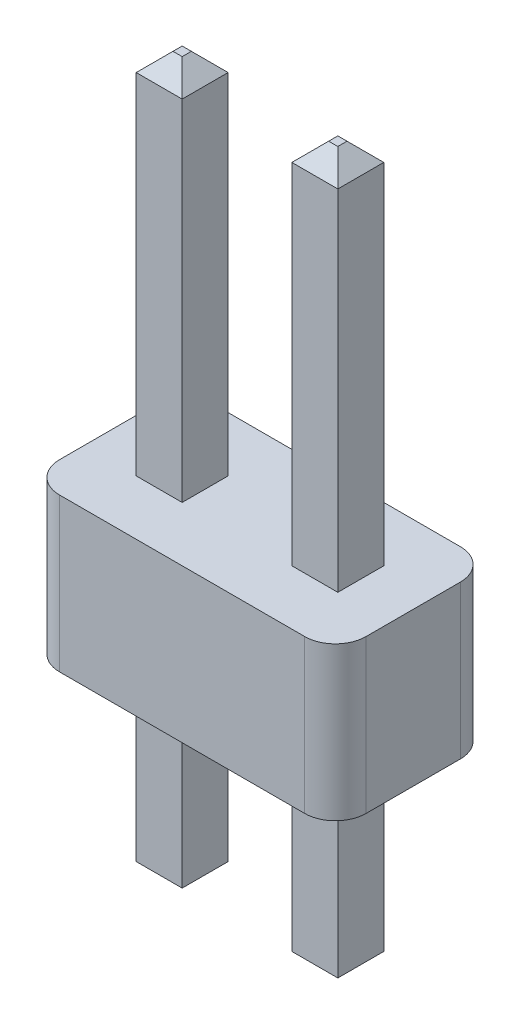
ISO-10303-21;
HEADER;
FILE_DESCRIPTION(('STEP AP214'),'2;1');
FILE_NAME('part.step','',(''),(''),'','','');
FILE_SCHEMA(('AUTOMOTIVE_DESIGN { 1 0 10303 214 1 1 1 1 }'));
ENDSEC;
DATA;
#1=APPLICATION_CONTEXT('core data for automotive mechanical design processes');
#2=APPLICATION_PROTOCOL_DEFINITION('international standard','automotive_design',2000,#1);
#3=PRODUCT_CONTEXT('',#1,'mechanical');
#4=PRODUCT('Part','Part','',(#3));
#5=PRODUCT_RELATED_PRODUCT_CATEGORY('part','',(#4));
#6=PRODUCT_DEFINITION_FORMATION('','',#4);
#7=PRODUCT_DEFINITION_CONTEXT('part definition',#1,'design');
#8=PRODUCT_DEFINITION('design','',#6,#7);
#9=PRODUCT_DEFINITION_SHAPE('','',#8);
#10=(LENGTH_UNIT() NAMED_UNIT(*) SI_UNIT(.MILLI.,.METRE.));
#11=(NAMED_UNIT(*) PLANE_ANGLE_UNIT() SI_UNIT($,.RADIAN.));
#12=(NAMED_UNIT(*) SI_UNIT($,.STERADIAN.) SOLID_ANGLE_UNIT());
#13=UNCERTAINTY_MEASURE_WITH_UNIT(LENGTH_MEASURE(1.E-05),#10,'distance_accuracy_value','');
#14=(GEOMETRIC_REPRESENTATION_CONTEXT(3) GLOBAL_UNCERTAINTY_ASSIGNED_CONTEXT((#13)) GLOBAL_UNIT_ASSIGNED_CONTEXT((#10,
#11,#12)) REPRESENTATION_CONTEXT('',''));
#15=CARTESIAN_POINT('',(0.,0.,0.));
#16=DIRECTION('',(0.,0.,1.));
#17=DIRECTION('',(1.,0.,0.));
#18=AXIS2_PLACEMENT_3D('',#15,#16,#17);
#19=CARTESIAN_POINT('',(2.,2.5,0.77));
#20=DIRECTION('',(0.,-1.,0.));
#21=DIRECTION('',(0.,0.,-1.));
#22=AXIS2_PLACEMENT_3D('',#19,#20,#21);
#23=CYLINDRICAL_SURFACE('',#22,0.5);
#24=CARTESIAN_POINT('',(2.,0.,0.77));
#25=DIRECTION('',(0.,1.,0.));
#26=DIRECTION('',(0.,0.,1.));
#27=AXIS2_PLACEMENT_3D('',#24,#25,#26);
#28=CIRCLE('',#27,0.5);
#29=CARTESIAN_POINT('',(2.,0.,1.27));
#30=VERTEX_POINT('',#29);
#31=CARTESIAN_POINT('',(2.5,0.,0.77));
#32=VERTEX_POINT('',#31);
#33=EDGE_CURVE('E302',#30,#32,#28,.T.);
#34=ORIENTED_EDGE('',*,*,#33,.T.);
#35=DIRECTION('',(0.,-1.,0.));
#36=VECTOR('',#35,1.);
#37=CARTESIAN_POINT('',(2.5,2.5,0.77));
#38=LINE('',#37,#36);
#39=CARTESIAN_POINT('',(2.5,2.5,0.77));
#40=VERTEX_POINT('',#39);
#41=EDGE_CURVE('E361',#40,#32,#38,.T.);
#42=ORIENTED_EDGE('',*,*,#41,.F.);
#43=CARTESIAN_POINT('',(2.,2.5,0.77));
#44=DIRECTION('',(0.,1.,0.));
#45=DIRECTION('',(0.,0.,1.));
#46=AXIS2_PLACEMENT_3D('',#43,#44,#45);
#47=CIRCLE('',#46,0.5);
#48=CARTESIAN_POINT('',(2.,2.5,1.27));
#49=VERTEX_POINT('',#48);
#50=EDGE_CURVE('E303',#49,#40,#47,.T.);
#51=ORIENTED_EDGE('',*,*,#50,.F.);
#52=DIRECTION('',(0.,-1.,0.));
#53=VECTOR('',#52,1.);
#54=CARTESIAN_POINT('',(2.,2.5,1.27));
#55=LINE('',#54,#53);
#56=EDGE_CURVE('E323',#49,#30,#55,.T.);
#57=ORIENTED_EDGE('',*,*,#56,.T.);
#58=EDGE_LOOP('',(#34,#42,#51,#57));
#59=FACE_BOUND('',#58,.T.);
#60=ADVANCED_FACE('F36',(#59),#23,.T.);
#61=CARTESIAN_POINT('',(2.5,2.5,-0.77));
#62=DIRECTION('',(-1.,0.,0.));
#63=DIRECTION('',(0.,0.,1.));
#64=AXIS2_PLACEMENT_3D('',#61,#62,#63);
#65=PLANE('',#64);
#66=DIRECTION('',(0.,0.,-1.));
#67=VECTOR('',#66,1.);
#68=CARTESIAN_POINT('',(2.5,0.,-0.77));
#69=LINE('',#68,#67);
#70=CARTESIAN_POINT('',(2.5,0.,-0.77));
#71=VERTEX_POINT('',#70);
#72=EDGE_CURVE('E326',#32,#71,#69,.T.);
#73=ORIENTED_EDGE('',*,*,#72,.T.);
#74=DIRECTION('',(0.,-1.,0.));
#75=VECTOR('',#74,1.);
#76=CARTESIAN_POINT('',(2.5,2.5,-0.77));
#77=LINE('',#76,#75);
#78=CARTESIAN_POINT('',(2.5,2.5,-0.77));
#79=VERTEX_POINT('',#78);
#80=EDGE_CURVE('E358',#79,#71,#77,.T.);
#81=ORIENTED_EDGE('',*,*,#80,.F.);
#82=DIRECTION('',(0.,0.,-1.));
#83=VECTOR('',#82,1.);
#84=CARTESIAN_POINT('',(2.5,2.5,-0.77));
#85=LINE('',#84,#83);
#86=EDGE_CURVE('E306',#40,#79,#85,.T.);
#87=ORIENTED_EDGE('',*,*,#86,.F.);
#88=ORIENTED_EDGE('',*,*,#41,.T.);
#89=EDGE_LOOP('',(#73,#81,#87,#88));
#90=FACE_BOUND('',#89,.T.);
#91=ADVANCED_FACE('F527',(#90),#65,.F.);
#92=CARTESIAN_POINT('',(2.,2.5,-0.77));
#93=DIRECTION('',(0.,-1.,0.));
#94=DIRECTION('',(0.,0.,-1.));
#95=AXIS2_PLACEMENT_3D('',#92,#93,#94);
#96=CYLINDRICAL_SURFACE('',#95,0.5);
#97=CARTESIAN_POINT('',(2.,0.,-0.77));
#98=DIRECTION('',(0.,1.,0.));
#99=DIRECTION('',(0.,0.,1.));
#100=AXIS2_PLACEMENT_3D('',#97,#98,#99);
#101=CIRCLE('',#100,0.5);
#102=CARTESIAN_POINT('',(2.,0.,-1.27));
#103=VERTEX_POINT('',#102);
#104=EDGE_CURVE('E328',#71,#103,#101,.T.);
#105=ORIENTED_EDGE('',*,*,#104,.T.);
#106=DIRECTION('',(0.,-1.,0.));
#107=VECTOR('',#106,1.);
#108=CARTESIAN_POINT('',(2.,2.5,-1.27));
#109=LINE('',#108,#107);
#110=CARTESIAN_POINT('',(2.,2.5,-1.27));
#111=VERTEX_POINT('',#110);
#112=EDGE_CURVE('E355',#111,#103,#109,.T.);
#113=ORIENTED_EDGE('',*,*,#112,.F.);
#114=CARTESIAN_POINT('',(2.,2.5,-0.77));
#115=DIRECTION('',(0.,1.,0.));
#116=DIRECTION('',(0.,0.,1.));
#117=AXIS2_PLACEMENT_3D('',#114,#115,#116);
#118=CIRCLE('',#117,0.5);
#119=EDGE_CURVE('E309',#79,#111,#118,.T.);
#120=ORIENTED_EDGE('',*,*,#119,.F.);
#121=ORIENTED_EDGE('',*,*,#80,.T.);
#122=EDGE_LOOP('',(#105,#113,#120,#121));
#123=FACE_BOUND('',#122,.T.);
#124=ADVANCED_FACE('F533',(#123),#96,.T.);
#125=CARTESIAN_POINT('',(-2.,2.5,-1.27));
#126=DIRECTION('',(0.,0.,1.));
#127=DIRECTION('',(1.,0.,0.));
#128=AXIS2_PLACEMENT_3D('',#125,#126,#127);
#129=PLANE('',#128);
#130=DIRECTION('',(-1.,0.,0.));
#131=VECTOR('',#130,1.);
#132=CARTESIAN_POINT('',(-2.,0.,-1.27));
#133=LINE('',#132,#131);
#134=CARTESIAN_POINT('',(-2.,0.,-1.27));
#135=VERTEX_POINT('',#134);
#136=EDGE_CURVE('E330',#103,#135,#133,.T.);
#137=ORIENTED_EDGE('',*,*,#136,.T.);
#138=DIRECTION('',(0.,-1.,0.));
#139=VECTOR('',#138,1.);
#140=CARTESIAN_POINT('',(-2.,2.5,-1.27));
#141=LINE('',#140,#139);
#142=CARTESIAN_POINT('',(-2.,2.5,-1.27));
#143=VERTEX_POINT('',#142);
#144=EDGE_CURVE('E352',#143,#135,#141,.T.);
#145=ORIENTED_EDGE('',*,*,#144,.F.);
#146=DIRECTION('',(-1.,0.,0.));
#147=VECTOR('',#146,1.);
#148=CARTESIAN_POINT('',(-2.,2.5,-1.27));
#149=LINE('',#148,#147);
#150=EDGE_CURVE('E311',#111,#143,#149,.T.);
#151=ORIENTED_EDGE('',*,*,#150,.F.);
#152=ORIENTED_EDGE('',*,*,#112,.T.);
#153=EDGE_LOOP('',(#137,#145,#151,#152));
#154=FACE_BOUND('',#153,.T.);
#155=ADVANCED_FACE('F877',(#154),#129,.F.);
#156=CARTESIAN_POINT('',(-2.,2.5,-0.77));
#157=DIRECTION('',(0.,-1.,0.));
#158=DIRECTION('',(0.,0.,-1.));
#159=AXIS2_PLACEMENT_3D('',#156,#157,#158);
#160=CYLINDRICAL_SURFACE('',#159,0.5);
#161=CARTESIAN_POINT('',(-2.,0.,-0.77));
#162=DIRECTION('',(0.,1.,0.));
#163=DIRECTION('',(0.,0.,1.));
#164=AXIS2_PLACEMENT_3D('',#161,#162,#163);
#165=CIRCLE('',#164,0.5);
#166=CARTESIAN_POINT('',(-2.5,0.,-0.77));
#167=VERTEX_POINT('',#166);
#168=EDGE_CURVE('E333',#135,#167,#165,.T.);
#169=ORIENTED_EDGE('',*,*,#168,.T.);
#170=DIRECTION('',(0.,-1.,0.));
#171=VECTOR('',#170,1.);
#172=CARTESIAN_POINT('',(-2.5,2.5,-0.77));
#173=LINE('',#172,#171);
#174=CARTESIAN_POINT('',(-2.5,2.5,-0.77));
#175=VERTEX_POINT('',#174);
#176=EDGE_CURVE('E349',#175,#167,#173,.T.);
#177=ORIENTED_EDGE('',*,*,#176,.F.);
#178=CARTESIAN_POINT('',(-2.,2.5,-0.77));
#179=DIRECTION('',(0.,1.,0.));
#180=DIRECTION('',(0.,0.,1.));
#181=AXIS2_PLACEMENT_3D('',#178,#179,#180);
#182=CIRCLE('',#181,0.5);
#183=EDGE_CURVE('E314',#143,#175,#182,.T.);
#184=ORIENTED_EDGE('',*,*,#183,.F.);
#185=ORIENTED_EDGE('',*,*,#144,.T.);
#186=EDGE_LOOP('',(#169,#177,#184,#185));
#187=FACE_BOUND('',#186,.T.);
#188=ADVANCED_FACE('F866',(#187),#160,.T.);
#189=CARTESIAN_POINT('',(-2.5,2.5,0.77));
#190=DIRECTION('',(1.,0.,0.));
#191=DIRECTION('',(0.,0.,-1.));
#192=AXIS2_PLACEMENT_3D('',#189,#190,#191);
#193=PLANE('',#192);
#194=DIRECTION('',(0.,0.,1.));
#195=VECTOR('',#194,1.);
#196=CARTESIAN_POINT('',(-2.5,0.,0.77));
#197=LINE('',#196,#195);
#198=CARTESIAN_POINT('',(-2.5,0.,0.77));
#199=VERTEX_POINT('',#198);
#200=EDGE_CURVE('E335',#167,#199,#197,.T.);
#201=ORIENTED_EDGE('',*,*,#200,.T.);
#202=DIRECTION('',(0.,-1.,0.));
#203=VECTOR('',#202,1.);
#204=CARTESIAN_POINT('',(-2.5,2.5,0.77));
#205=LINE('',#204,#203);
#206=CARTESIAN_POINT('',(-2.5,2.5,0.77));
#207=VERTEX_POINT('',#206);
#208=EDGE_CURVE('E346',#207,#199,#205,.T.);
#209=ORIENTED_EDGE('',*,*,#208,.F.);
#210=DIRECTION('',(0.,0.,1.));
#211=VECTOR('',#210,1.);
#212=CARTESIAN_POINT('',(-2.5,2.5,0.77));
#213=LINE('',#212,#211);
#214=EDGE_CURVE('E316',#175,#207,#213,.T.);
#215=ORIENTED_EDGE('',*,*,#214,.F.);
#216=ORIENTED_EDGE('',*,*,#176,.T.);
#217=EDGE_LOOP('',(#201,#209,#215,#216));
#218=FACE_BOUND('',#217,.T.);
#219=ADVANCED_FACE('F855',(#218),#193,.F.);
#220=CARTESIAN_POINT('',(-2.,2.5,0.77));
#221=DIRECTION('',(0.,-1.,0.));
#222=DIRECTION('',(0.,0.,-1.));
#223=AXIS2_PLACEMENT_3D('',#220,#221,#222);
#224=CYLINDRICAL_SURFACE('',#223,0.5);
#225=CARTESIAN_POINT('',(-2.,0.,0.77));
#226=DIRECTION('',(0.,1.,0.));
#227=DIRECTION('',(0.,0.,1.));
#228=AXIS2_PLACEMENT_3D('',#225,#226,#227);
#229=CIRCLE('',#228,0.5);
#230=CARTESIAN_POINT('',(-2.,0.,1.27));
#231=VERTEX_POINT('',#230);
#232=EDGE_CURVE('E337',#199,#231,#229,.T.);
#233=ORIENTED_EDGE('',*,*,#232,.T.);
#234=DIRECTION('',(0.,-1.,0.));
#235=VECTOR('',#234,1.);
#236=CARTESIAN_POINT('',(-2.,2.5,1.27));
#237=LINE('',#236,#235);
#238=CARTESIAN_POINT('',(-2.,2.5,1.27));
#239=VERTEX_POINT('',#238);
#240=EDGE_CURVE('E343',#239,#231,#237,.T.);
#241=ORIENTED_EDGE('',*,*,#240,.F.);
#242=CARTESIAN_POINT('',(-2.,2.5,0.77));
#243=DIRECTION('',(0.,1.,0.));
#244=DIRECTION('',(0.,0.,1.));
#245=AXIS2_PLACEMENT_3D('',#242,#243,#244);
#246=CIRCLE('',#245,0.5);
#247=EDGE_CURVE('E318',#207,#239,#246,.T.);
#248=ORIENTED_EDGE('',*,*,#247,.F.);
#249=ORIENTED_EDGE('',*,*,#208,.T.);
#250=EDGE_LOOP('',(#233,#241,#248,#249));
#251=FACE_BOUND('',#250,.T.);
#252=ADVANCED_FACE('F844',(#251),#224,.T.);
#253=CARTESIAN_POINT('',(2.,2.5,1.27));
#254=DIRECTION('',(0.,0.,-1.));
#255=DIRECTION('',(-1.,0.,0.));
#256=AXIS2_PLACEMENT_3D('',#253,#254,#255);
#257=PLANE('',#256);
#258=DIRECTION('',(1.,0.,0.));
#259=VECTOR('',#258,1.);
#260=CARTESIAN_POINT('',(2.,0.,1.27));
#261=LINE('',#260,#259);
#262=EDGE_CURVE('E307',#231,#30,#261,.T.);
#263=ORIENTED_EDGE('',*,*,#262,.T.);
#264=ORIENTED_EDGE('',*,*,#56,.F.);
#265=DIRECTION('',(1.,0.,0.));
#266=VECTOR('',#265,1.);
#267=CARTESIAN_POINT('',(2.,2.5,1.27));
#268=LINE('',#267,#266);
#269=EDGE_CURVE('E320',#239,#49,#268,.T.);
#270=ORIENTED_EDGE('',*,*,#269,.F.);
#271=ORIENTED_EDGE('',*,*,#240,.T.);
#272=EDGE_LOOP('',(#263,#264,#270,#271));
#273=FACE_BOUND('',#272,.T.);
#274=ADVANCED_FACE('F834',(#273),#257,.F.);
#275=CARTESIAN_POINT('',(2.,2.5,0.77));
#276=DIRECTION('',(0.,1.,0.));
#277=DIRECTION('',(0.,0.,1.));
#278=AXIS2_PLACEMENT_3D('',#275,#276,#277);
#279=PLANE('',#278);
#280=DIRECTION('',(0.,0.,1.));
#281=VECTOR('',#280,1.);
#282=CARTESIAN_POINT('',(0.895,2.5,0.77));
#283=LINE('',#282,#281);
#284=CARTESIAN_POINT('',(0.895,2.5,-0.375));
#285=VERTEX_POINT('',#284);
#286=CARTESIAN_POINT('',(0.895,2.5,0.375));
#287=VERTEX_POINT('',#286);
#288=EDGE_CURVE('E276',#285,#287,#283,.T.);
#289=ORIENTED_EDGE('',*,*,#288,.F.);
#290=DIRECTION('',(-1.,0.,0.));
#291=VECTOR('',#290,1.);
#292=CARTESIAN_POINT('',(2.,2.5,-0.375));
#293=LINE('',#292,#291);
#294=CARTESIAN_POINT('',(1.645,2.5,-0.375));
#295=VERTEX_POINT('',#294);
#296=EDGE_CURVE('E254',#295,#285,#293,.T.);
#297=ORIENTED_EDGE('',*,*,#296,.F.);
#298=DIRECTION('',(0.,0.,-1.));
#299=VECTOR('',#298,1.);
#300=CARTESIAN_POINT('',(1.645,2.5,0.77));
#301=LINE('',#300,#299);
#302=CARTESIAN_POINT('',(1.645,2.5,0.375));
#303=VERTEX_POINT('',#302);
#304=EDGE_CURVE('E247',#303,#295,#301,.T.);
#305=ORIENTED_EDGE('',*,*,#304,.F.);
#306=DIRECTION('',(1.,0.,0.));
#307=VECTOR('',#306,1.);
#308=CARTESIAN_POINT('',(2.,2.5,0.375));
#309=LINE('',#308,#307);
#310=EDGE_CURVE('E251',#287,#303,#309,.T.);
#311=ORIENTED_EDGE('',*,*,#310,.F.);
#312=EDGE_LOOP('',(#289,#297,#305,#311));
#313=FACE_BOUND('',#312,.T.);
#314=DIRECTION('',(0.,0.,-1.));
#315=VECTOR('',#314,1.);
#316=CARTESIAN_POINT('',(-0.895,2.5,0.77));
#317=LINE('',#316,#315);
#318=CARTESIAN_POINT('',(-0.895,2.5,0.375));
#319=VERTEX_POINT('',#318);
#320=CARTESIAN_POINT('',(-0.895,2.5,-0.375));
#321=VERTEX_POINT('',#320);
#322=EDGE_CURVE('E299',#319,#321,#317,.T.);
#323=ORIENTED_EDGE('',*,*,#322,.F.);
#324=DIRECTION('',(1.,0.,0.));
#325=VECTOR('',#324,1.);
#326=CARTESIAN_POINT('',(2.,2.5,0.375));
#327=LINE('',#326,#325);
#328=CARTESIAN_POINT('',(-1.645,2.5,0.375));
#329=VERTEX_POINT('',#328);
#330=EDGE_CURVE('E296',#329,#319,#327,.T.);
#331=ORIENTED_EDGE('',*,*,#330,.F.);
#332=DIRECTION('',(0.,0.,1.));
#333=VECTOR('',#332,1.);
#334=CARTESIAN_POINT('',(-1.645,2.5,0.77));
#335=LINE('',#334,#333);
#336=CARTESIAN_POINT('',(-1.645,2.5,-0.375));
#337=VERTEX_POINT('',#336);
#338=EDGE_CURVE('E293',#337,#329,#335,.T.);
#339=ORIENTED_EDGE('',*,*,#338,.F.);
#340=DIRECTION('',(-1.,0.,0.));
#341=VECTOR('',#340,1.);
#342=CARTESIAN_POINT('',(2.,2.5,-0.375));
#343=LINE('',#342,#341);
#344=EDGE_CURVE('E281',#321,#337,#343,.T.);
#345=ORIENTED_EDGE('',*,*,#344,.F.);
#346=EDGE_LOOP('',(#323,#331,#339,#345));
#347=FACE_BOUND('',#346,.T.);
#348=ORIENTED_EDGE('',*,*,#50,.T.);
#349=ORIENTED_EDGE('',*,*,#86,.T.);
#350=ORIENTED_EDGE('',*,*,#119,.T.);
#351=ORIENTED_EDGE('',*,*,#150,.T.);
#352=ORIENTED_EDGE('',*,*,#183,.T.);
#353=ORIENTED_EDGE('',*,*,#214,.T.);
#354=ORIENTED_EDGE('',*,*,#247,.T.);
#355=ORIENTED_EDGE('',*,*,#269,.T.);
#356=EDGE_LOOP('',(#348,#349,#350,#351,#352,#353,#354,#355));
#357=FACE_BOUND('',#356,.T.);
#358=ADVANCED_FACE('F249',(#313,#347,#357),#279,.T.);
#359=CARTESIAN_POINT('',(2.,0.,0.77));
#360=DIRECTION('',(0.,1.,0.));
#361=DIRECTION('',(0.,0.,1.));
#362=AXIS2_PLACEMENT_3D('',#359,#360,#361);
#363=PLANE('',#362);
#364=DIRECTION('',(-1.,0.,0.));
#365=VECTOR('',#364,1.);
#366=CARTESIAN_POINT('',(2.,0.,-0.375));
#367=LINE('',#366,#365);
#368=CARTESIAN_POINT('',(1.645,0.,-0.375));
#369=VERTEX_POINT('',#368);
#370=CARTESIAN_POINT('',(0.895,0.,-0.375));
#371=VERTEX_POINT('',#370);
#372=EDGE_CURVE('E382',#369,#371,#367,.T.);
#373=ORIENTED_EDGE('',*,*,#372,.T.);
#374=DIRECTION('',(0.,0.,1.));
#375=VECTOR('',#374,1.);
#376=CARTESIAN_POINT('',(0.895,0.,0.77));
#377=LINE('',#376,#375);
#378=CARTESIAN_POINT('',(0.895,0.,0.375));
#379=VERTEX_POINT('',#378);
#380=EDGE_CURVE('E385',#371,#379,#377,.T.);
#381=ORIENTED_EDGE('',*,*,#380,.T.);
#382=DIRECTION('',(1.,0.,0.));
#383=VECTOR('',#382,1.);
#384=CARTESIAN_POINT('',(2.,0.,0.375));
#385=LINE('',#384,#383);
#386=CARTESIAN_POINT('',(1.645,0.,0.375));
#387=VERTEX_POINT('',#386);
#388=EDGE_CURVE('E376',#379,#387,#385,.T.);
#389=ORIENTED_EDGE('',*,*,#388,.T.);
#390=DIRECTION('',(0.,0.,-1.));
#391=VECTOR('',#390,1.);
#392=CARTESIAN_POINT('',(1.645,0.,0.77));
#393=LINE('',#392,#391);
#394=EDGE_CURVE('E379',#387,#369,#393,.T.);
#395=ORIENTED_EDGE('',*,*,#394,.T.);
#396=EDGE_LOOP('',(#373,#381,#389,#395));
#397=FACE_BOUND('',#396,.T.);
#398=DIRECTION('',(1.,0.,0.));
#399=VECTOR('',#398,1.);
#400=CARTESIAN_POINT('',(2.,0.,0.375));
#401=LINE('',#400,#399);
#402=CARTESIAN_POINT('',(-1.645,0.,0.375));
#403=VERTEX_POINT('',#402);
#404=CARTESIAN_POINT('',(-0.895,0.,0.375));
#405=VERTEX_POINT('',#404);
#406=EDGE_CURVE('E370',#403,#405,#401,.T.);
#407=ORIENTED_EDGE('',*,*,#406,.T.);
#408=DIRECTION('',(0.,0.,-1.));
#409=VECTOR('',#408,1.);
#410=CARTESIAN_POINT('',(-0.895,0.,0.77));
#411=LINE('',#410,#409);
#412=CARTESIAN_POINT('',(-0.895,0.,-0.375));
#413=VERTEX_POINT('',#412);
#414=EDGE_CURVE('E373',#405,#413,#411,.T.);
#415=ORIENTED_EDGE('',*,*,#414,.T.);
#416=DIRECTION('',(-1.,0.,0.));
#417=VECTOR('',#416,1.);
#418=CARTESIAN_POINT('',(2.,0.,-0.375));
#419=LINE('',#418,#417);
#420=CARTESIAN_POINT('',(-1.645,0.,-0.375));
#421=VERTEX_POINT('',#420);
#422=EDGE_CURVE('E364',#413,#421,#419,.T.);
#423=ORIENTED_EDGE('',*,*,#422,.T.);
#424=DIRECTION('',(0.,0.,1.));
#425=VECTOR('',#424,1.);
#426=CARTESIAN_POINT('',(-1.645,0.,0.77));
#427=LINE('',#426,#425);
#428=EDGE_CURVE('E367',#421,#403,#427,.T.);
#429=ORIENTED_EDGE('',*,*,#428,.T.);
#430=EDGE_LOOP('',(#407,#415,#423,#429));
#431=FACE_BOUND('',#430,.T.);
#432=ORIENTED_EDGE('',*,*,#33,.F.);
#433=ORIENTED_EDGE('',*,*,#262,.F.);
#434=ORIENTED_EDGE('',*,*,#232,.F.);
#435=ORIENTED_EDGE('',*,*,#200,.F.);
#436=ORIENTED_EDGE('',*,*,#168,.F.);
#437=ORIENTED_EDGE('',*,*,#136,.F.);
#438=ORIENTED_EDGE('',*,*,#104,.F.);
#439=ORIENTED_EDGE('',*,*,#72,.F.);
#440=EDGE_LOOP('',(#432,#433,#434,#435,#436,#437,#438,#439));
#441=FACE_BOUND('',#440,.T.);
#442=ADVANCED_FACE('F813',(#397,#431,#441),#363,.F.);
#443=CARTESIAN_POINT('',(0.,-3.25,0.));
#444=DIRECTION('',(0.,-1.,0.));
#445=DIRECTION('',(0.,0.,-1.));
#446=AXIS2_PLACEMENT_3D('',#443,#444,#445);
#447=PLANE('',#446);
#448=DIRECTION('',(0.,0.,1.));
#449=VECTOR('',#448,1.);
#450=CARTESIAN_POINT('',(-1.195,-3.25,0.));
#451=LINE('',#450,#449);
#452=CARTESIAN_POINT('',(-1.195,-3.25,-0.0750000000000004));
#453=VERTEX_POINT('',#452);
#454=CARTESIAN_POINT('',(-1.195,-3.25,0.075));
#455=VERTEX_POINT('',#454);
#456=EDGE_CURVE('E411',#453,#455,#451,.T.);
#457=ORIENTED_EDGE('',*,*,#456,.T.);
#458=DIRECTION('',(-1.,0.,0.));
#459=VECTOR('',#458,1.);
#460=CARTESIAN_POINT('',(0.,-3.25,0.075));
#461=LINE('',#460,#459);
#462=CARTESIAN_POINT('',(-1.345,-3.25,0.075));
#463=VERTEX_POINT('',#462);
#464=EDGE_CURVE('E415',#455,#463,#461,.T.);
#465=ORIENTED_EDGE('',*,*,#464,.T.);
#466=DIRECTION('',(0.,0.,-1.));
#467=VECTOR('',#466,1.);
#468=CARTESIAN_POINT('',(-1.345,-3.25,0.));
#469=LINE('',#468,#467);
#470=CARTESIAN_POINT('',(-1.345,-3.25,-0.0750000000000004));
#471=VERTEX_POINT('',#470);
#472=EDGE_CURVE('E413',#463,#471,#469,.T.);
#473=ORIENTED_EDGE('',*,*,#472,.T.);
#474=DIRECTION('',(1.,0.,0.));
#475=VECTOR('',#474,1.);
#476=CARTESIAN_POINT('',(0.,-3.25,-0.0750000000000004));
#477=LINE('',#476,#475);
#478=EDGE_CURVE('E409',#471,#453,#477,.T.);
#479=ORIENTED_EDGE('',*,*,#478,.T.);
#480=EDGE_LOOP('',(#457,#465,#473,#479));
#481=FACE_BOUND('',#480,.T.);
#482=ADVANCED_FACE('F804',(#481),#447,.T.);
#483=CARTESIAN_POINT('',(-1.645,-3.25,-0.375));
#484=DIRECTION('',(0.,0.,-1.));
#485=DIRECTION('',(-1.,0.,0.));
#486=AXIS2_PLACEMENT_3D('',#483,#484,#485);
#487=PLANE('',#486);
#488=DIRECTION('',(0.,1.,0.));
#489=VECTOR('',#488,1.);
#490=CARTESIAN_POINT('',(-0.895,-3.25,-0.375));
#491=LINE('',#490,#489);
#492=CARTESIAN_POINT('',(-0.895,-2.95,-0.375));
#493=VERTEX_POINT('',#492);
#494=EDGE_CURVE('E289',#493,#413,#491,.T.);
#495=ORIENTED_EDGE('',*,*,#494,.F.);
#496=DIRECTION('',(-1.,0.,0.));
#497=VECTOR('',#496,1.);
#498=CARTESIAN_POINT('',(-1.645,-2.95,-0.375));
#499=LINE('',#498,#497);
#500=CARTESIAN_POINT('',(-1.645,-2.95,-0.375));
#501=VERTEX_POINT('',#500);
#502=EDGE_CURVE('E422',#493,#501,#499,.T.);
#503=ORIENTED_EDGE('',*,*,#502,.T.);
#504=DIRECTION('',(0.,1.,0.));
#505=VECTOR('',#504,1.);
#506=CARTESIAN_POINT('',(-1.645,-3.25,-0.375));
#507=LINE('',#506,#505);
#508=EDGE_CURVE('E286',#501,#421,#507,.T.);
#509=ORIENTED_EDGE('',*,*,#508,.T.);
#510=ORIENTED_EDGE('',*,*,#422,.F.);
#511=EDGE_LOOP('',(#495,#503,#509,#510));
#512=FACE_BOUND('',#511,.T.);
#513=ADVANCED_FACE('F740',(#512),#487,.T.);
#514=CARTESIAN_POINT('',(-1.645,-3.25,0.375));
#515=DIRECTION('',(-1.,0.,0.));
#516=DIRECTION('',(0.,0.,1.));
#517=AXIS2_PLACEMENT_3D('',#514,#515,#516);
#518=PLANE('',#517);
#519=ORIENTED_EDGE('',*,*,#508,.F.);
#520=DIRECTION('',(0.,0.,1.));
#521=VECTOR('',#520,1.);
#522=CARTESIAN_POINT('',(-1.645,-2.95,0.375));
#523=LINE('',#522,#521);
#524=CARTESIAN_POINT('',(-1.645,-2.95,0.375));
#525=VERTEX_POINT('',#524);
#526=EDGE_CURVE('E418',#501,#525,#523,.T.);
#527=ORIENTED_EDGE('',*,*,#526,.T.);
#528=DIRECTION('',(0.,1.,0.));
#529=VECTOR('',#528,1.);
#530=CARTESIAN_POINT('',(-1.645,-3.25,0.375));
#531=LINE('',#530,#529);
#532=EDGE_CURVE('E283',#525,#403,#531,.T.);
#533=ORIENTED_EDGE('',*,*,#532,.T.);
#534=ORIENTED_EDGE('',*,*,#428,.F.);
#535=EDGE_LOOP('',(#519,#527,#533,#534));
#536=FACE_BOUND('',#535,.T.);
#537=ADVANCED_FACE('F751',(#536),#518,.T.);
#538=CARTESIAN_POINT('',(-0.895,-3.25,0.375));
#539=DIRECTION('',(0.,0.,1.));
#540=DIRECTION('',(1.,0.,0.));
#541=AXIS2_PLACEMENT_3D('',#538,#539,#540);
#542=PLANE('',#541);
#543=ORIENTED_EDGE('',*,*,#532,.F.);
#544=DIRECTION('',(1.,0.,0.));
#545=VECTOR('',#544,1.);
#546=CARTESIAN_POINT('',(-0.895,-2.95,0.375));
#547=LINE('',#546,#545);
#548=CARTESIAN_POINT('',(-0.895,-2.95,0.375));
#549=VERTEX_POINT('',#548);
#550=EDGE_CURVE('E406',#525,#549,#547,.T.);
#551=ORIENTED_EDGE('',*,*,#550,.T.);
#552=DIRECTION('',(0.,1.,0.));
#553=VECTOR('',#552,1.);
#554=CARTESIAN_POINT('',(-0.895,-3.25,0.375));
#555=LINE('',#554,#553);
#556=EDGE_CURVE('E279',#549,#405,#555,.T.);
#557=ORIENTED_EDGE('',*,*,#556,.T.);
#558=ORIENTED_EDGE('',*,*,#406,.F.);
#559=EDGE_LOOP('',(#543,#551,#557,#558));
#560=FACE_BOUND('',#559,.T.);
#561=ADVANCED_FACE('F762',(#560),#542,.T.);
#562=CARTESIAN_POINT('',(-0.895,-3.25,-0.375));
#563=DIRECTION('',(1.,0.,0.));
#564=DIRECTION('',(0.,0.,-1.));
#565=AXIS2_PLACEMENT_3D('',#562,#563,#564);
#566=PLANE('',#565);
#567=ORIENTED_EDGE('',*,*,#556,.F.);
#568=DIRECTION('',(0.,0.,-1.));
#569=VECTOR('',#568,1.);
#570=CARTESIAN_POINT('',(-0.895,-2.95,-0.375));
#571=LINE('',#570,#569);
#572=EDGE_CURVE('E420',#549,#493,#571,.T.);
#573=ORIENTED_EDGE('',*,*,#572,.T.);
#574=ORIENTED_EDGE('',*,*,#494,.T.);
#575=ORIENTED_EDGE('',*,*,#414,.F.);
#576=EDGE_LOOP('',(#567,#573,#574,#575));
#577=FACE_BOUND('',#576,.T.);
#578=ADVANCED_FACE('F770',(#577),#566,.T.);
#579=CARTESIAN_POINT('',(-0.895,8.2,-0.375));
#580=VERTEX_POINT('',#579);
#581=EDGE_CURVE('E278',#321,#580,#491,.T.);
#582=ORIENTED_EDGE('',*,*,#581,.T.);
#583=DIRECTION('',(0.,0.,1.));
#584=VECTOR('',#583,1.);
#585=CARTESIAN_POINT('',(-0.895,8.2,0.375));
#586=LINE('',#585,#584);
#587=CARTESIAN_POINT('',(-0.895,8.2,0.375));
#588=VERTEX_POINT('',#587);
#589=EDGE_CURVE('E438',#580,#588,#586,.T.);
#590=ORIENTED_EDGE('',*,*,#589,.T.);
#591=EDGE_CURVE('E282',#319,#588,#555,.T.);
#592=ORIENTED_EDGE('',*,*,#591,.F.);
#593=ORIENTED_EDGE('',*,*,#322,.T.);
#594=EDGE_LOOP('',(#582,#590,#592,#593));
#595=FACE_BOUND('',#594,.T.);
#596=ADVANCED_FACE('F759',(#595),#566,.T.);
#597=ORIENTED_EDGE('',*,*,#591,.T.);
#598=DIRECTION('',(-1.,0.,0.));
#599=VECTOR('',#598,1.);
#600=CARTESIAN_POINT('',(-1.645,8.2,0.375));
#601=LINE('',#600,#599);
#602=CARTESIAN_POINT('',(-1.645,8.2,0.375));
#603=VERTEX_POINT('',#602);
#604=EDGE_CURVE('E440',#588,#603,#601,.T.);
#605=ORIENTED_EDGE('',*,*,#604,.T.);
#606=EDGE_CURVE('E285',#329,#603,#531,.T.);
#607=ORIENTED_EDGE('',*,*,#606,.F.);
#608=ORIENTED_EDGE('',*,*,#330,.T.);
#609=EDGE_LOOP('',(#597,#605,#607,#608));
#610=FACE_BOUND('',#609,.T.);
#611=ADVANCED_FACE('F748',(#610),#542,.T.);
#612=ORIENTED_EDGE('',*,*,#606,.T.);
#613=DIRECTION('',(0.,0.,-1.));
#614=VECTOR('',#613,1.);
#615=CARTESIAN_POINT('',(-1.645,8.2,-0.375));
#616=LINE('',#615,#614);
#617=CARTESIAN_POINT('',(-1.645,8.2,-0.375));
#618=VERTEX_POINT('',#617);
#619=EDGE_CURVE('E433',#603,#618,#616,.T.);
#620=ORIENTED_EDGE('',*,*,#619,.T.);
#621=EDGE_CURVE('E288',#337,#618,#507,.T.);
#622=ORIENTED_EDGE('',*,*,#621,.F.);
#623=ORIENTED_EDGE('',*,*,#338,.T.);
#624=EDGE_LOOP('',(#612,#620,#622,#623));
#625=FACE_BOUND('',#624,.T.);
#626=ADVANCED_FACE('F737',(#625),#518,.T.);
#627=ORIENTED_EDGE('',*,*,#621,.T.);
#628=DIRECTION('',(1.,0.,0.));
#629=VECTOR('',#628,1.);
#630=CARTESIAN_POINT('',(-0.895,8.2,-0.375));
#631=LINE('',#630,#629);
#632=EDGE_CURVE('E436',#618,#580,#631,.T.);
#633=ORIENTED_EDGE('',*,*,#632,.T.);
#634=ORIENTED_EDGE('',*,*,#581,.F.);
#635=ORIENTED_EDGE('',*,*,#344,.T.);
#636=EDGE_LOOP('',(#627,#633,#634,#635));
#637=FACE_BOUND('',#636,.T.);
#638=ADVANCED_FACE('F727',(#637),#487,.T.);
#639=CARTESIAN_POINT('',(0.,8.5,0.));
#640=DIRECTION('',(0.,-1.,0.));
#641=DIRECTION('',(0.,0.,-1.));
#642=AXIS2_PLACEMENT_3D('',#639,#640,#641);
#643=PLANE('',#642);
#644=DIRECTION('',(-1.,0.,0.));
#645=VECTOR('',#644,1.);
#646=CARTESIAN_POINT('',(-1.645,8.5,-0.0750000000000004));
#647=LINE('',#646,#645);
#648=CARTESIAN_POINT('',(-1.195,8.5,-0.0750000000000004));
#649=VERTEX_POINT('',#648);
#650=CARTESIAN_POINT('',(-1.345,8.5,-0.0750000000000004));
#651=VERTEX_POINT('',#650);
#652=EDGE_CURVE('E428',#649,#651,#647,.T.);
#653=ORIENTED_EDGE('',*,*,#652,.T.);
#654=DIRECTION('',(0.,0.,1.));
#655=VECTOR('',#654,1.);
#656=CARTESIAN_POINT('',(-1.345,8.5,0.375));
#657=LINE('',#656,#655);
#658=CARTESIAN_POINT('',(-1.345,8.5,0.075));
#659=VERTEX_POINT('',#658);
#660=EDGE_CURVE('E430',#651,#659,#657,.T.);
#661=ORIENTED_EDGE('',*,*,#660,.T.);
#662=DIRECTION('',(1.,0.,0.));
#663=VECTOR('',#662,1.);
#664=CARTESIAN_POINT('',(-0.895,8.5,0.075));
#665=LINE('',#664,#663);
#666=CARTESIAN_POINT('',(-1.195,8.5,0.075));
#667=VERTEX_POINT('',#666);
#668=EDGE_CURVE('E424',#659,#667,#665,.T.);
#669=ORIENTED_EDGE('',*,*,#668,.T.);
#670=DIRECTION('',(0.,0.,-1.));
#671=VECTOR('',#670,1.);
#672=CARTESIAN_POINT('',(-1.195,8.5,-0.375));
#673=LINE('',#672,#671);
#674=EDGE_CURVE('E426',#667,#649,#673,.T.);
#675=ORIENTED_EDGE('',*,*,#674,.T.);
#676=EDGE_LOOP('',(#653,#661,#669,#675));
#677=FACE_BOUND('',#676,.T.);
#678=ADVANCED_FACE('F718',(#677),#643,.F.);
#679=CARTESIAN_POINT('',(0.,-3.25,0.));
#680=DIRECTION('',(0.,-1.,0.));
#681=DIRECTION('',(0.,0.,-1.));
#682=AXIS2_PLACEMENT_3D('',#679,#680,#681);
#683=PLANE('',#682);
#684=DIRECTION('',(0.,0.,-1.));
#685=VECTOR('',#684,1.);
#686=CARTESIAN_POINT('',(1.195,-3.25,0.));
#687=LINE('',#686,#685);
#688=CARTESIAN_POINT('',(1.195,-3.25,0.0750000000000002));
#689=VERTEX_POINT('',#688);
#690=CARTESIAN_POINT('',(1.195,-3.25,-0.0750000000000004));
#691=VERTEX_POINT('',#690);
#692=EDGE_CURVE('E393',#689,#691,#687,.T.);
#693=ORIENTED_EDGE('',*,*,#692,.T.);
#694=DIRECTION('',(1.,0.,0.));
#695=VECTOR('',#694,1.);
#696=CARTESIAN_POINT('',(0.,-3.25,-0.0750000000000004));
#697=LINE('',#696,#695);
#698=CARTESIAN_POINT('',(1.345,-3.25,-0.0750000000000004));
#699=VERTEX_POINT('',#698);
#700=EDGE_CURVE('E397',#691,#699,#697,.T.);
#701=ORIENTED_EDGE('',*,*,#700,.T.);
#702=DIRECTION('',(0.,0.,1.));
#703=VECTOR('',#702,1.);
#704=CARTESIAN_POINT('',(1.345,-3.25,0.));
#705=LINE('',#704,#703);
#706=CARTESIAN_POINT('',(1.345,-3.25,0.0750000000000002));
#707=VERTEX_POINT('',#706);
#708=EDGE_CURVE('E395',#699,#707,#705,.T.);
#709=ORIENTED_EDGE('',*,*,#708,.T.);
#710=DIRECTION('',(-1.,0.,0.));
#711=VECTOR('',#710,1.);
#712=CARTESIAN_POINT('',(0.,-3.25,0.0750000000000002));
#713=LINE('',#712,#711);
#714=EDGE_CURVE('E391',#707,#689,#713,.T.);
#715=ORIENTED_EDGE('',*,*,#714,.T.);
#716=EDGE_LOOP('',(#693,#701,#709,#715));
#717=FACE_BOUND('',#716,.T.);
#718=ADVANCED_FACE('F709',(#717),#683,.T.);
#719=CARTESIAN_POINT('',(1.645,-3.25,0.375));
#720=DIRECTION('',(0.,0.,1.));
#721=DIRECTION('',(1.,0.,0.));
#722=AXIS2_PLACEMENT_3D('',#719,#720,#721);
#723=PLANE('',#722);
#724=DIRECTION('',(0.,1.,0.));
#725=VECTOR('',#724,1.);
#726=CARTESIAN_POINT('',(0.895,-3.25,0.375));
#727=LINE('',#726,#725);
#728=CARTESIAN_POINT('',(0.895,-2.95,0.375));
#729=VERTEX_POINT('',#728);
#730=EDGE_CURVE('E267',#729,#379,#727,.T.);
#731=ORIENTED_EDGE('',*,*,#730,.F.);
#732=DIRECTION('',(1.,0.,0.));
#733=VECTOR('',#732,1.);
#734=CARTESIAN_POINT('',(1.645,-2.95,0.375));
#735=LINE('',#734,#733);
#736=CARTESIAN_POINT('',(1.645,-2.95,0.375));
#737=VERTEX_POINT('',#736);
#738=EDGE_CURVE('E404',#729,#737,#735,.T.);
#739=ORIENTED_EDGE('',*,*,#738,.T.);
#740=DIRECTION('',(0.,1.,0.));
#741=VECTOR('',#740,1.);
#742=CARTESIAN_POINT('',(1.645,-3.25,0.375));
#743=LINE('',#742,#741);
#744=EDGE_CURVE('E266',#737,#387,#743,.T.);
#745=ORIENTED_EDGE('',*,*,#744,.T.);
#746=ORIENTED_EDGE('',*,*,#388,.F.);
#747=EDGE_LOOP('',(#731,#739,#745,#746));
#748=FACE_BOUND('',#747,.T.);
#749=ADVANCED_FACE('F524',(#748),#723,.T.);
#750=CARTESIAN_POINT('',(1.645,-3.25,-0.375));
#751=DIRECTION('',(1.,0.,0.));
#752=DIRECTION('',(0.,0.,-1.));
#753=AXIS2_PLACEMENT_3D('',#750,#751,#752);
#754=PLANE('',#753);
#755=ORIENTED_EDGE('',*,*,#744,.F.);
#756=DIRECTION('',(0.,0.,-1.));
#757=VECTOR('',#756,1.);
#758=CARTESIAN_POINT('',(1.645,-2.95,-0.375));
#759=LINE('',#758,#757);
#760=CARTESIAN_POINT('',(1.645,-2.95,-0.375));
#761=VERTEX_POINT('',#760);
#762=EDGE_CURVE('E400',#737,#761,#759,.T.);
#763=ORIENTED_EDGE('',*,*,#762,.T.);
#764=DIRECTION('',(0.,1.,0.));
#765=VECTOR('',#764,1.);
#766=CARTESIAN_POINT('',(1.645,-3.25,-0.375));
#767=LINE('',#766,#765);
#768=EDGE_CURVE('E272',#761,#369,#767,.T.);
#769=ORIENTED_EDGE('',*,*,#768,.T.);
#770=ORIENTED_EDGE('',*,*,#394,.F.);
#771=EDGE_LOOP('',(#755,#763,#769,#770));
#772=FACE_BOUND('',#771,.T.);
#773=ADVANCED_FACE('F659',(#772),#754,.T.);
#774=CARTESIAN_POINT('',(0.895,-3.25,-0.375));
#775=DIRECTION('',(0.,0.,-1.));
#776=DIRECTION('',(-1.,0.,0.));
#777=AXIS2_PLACEMENT_3D('',#774,#775,#776);
#778=PLANE('',#777);
#779=ORIENTED_EDGE('',*,*,#768,.F.);
#780=DIRECTION('',(-1.,0.,0.));
#781=VECTOR('',#780,1.);
#782=CARTESIAN_POINT('',(0.895,-2.95,-0.375));
#783=LINE('',#782,#781);
#784=CARTESIAN_POINT('',(0.895,-2.95,-0.375));
#785=VERTEX_POINT('',#784);
#786=EDGE_CURVE('E388',#761,#785,#783,.T.);
#787=ORIENTED_EDGE('',*,*,#786,.T.);
#788=DIRECTION('',(0.,1.,0.));
#789=VECTOR('',#788,1.);
#790=CARTESIAN_POINT('',(0.895,-3.25,-0.375));
#791=LINE('',#790,#789);
#792=EDGE_CURVE('E263',#785,#371,#791,.T.);
#793=ORIENTED_EDGE('',*,*,#792,.T.);
#794=ORIENTED_EDGE('',*,*,#372,.F.);
#795=EDGE_LOOP('',(#779,#787,#793,#794));
#796=FACE_BOUND('',#795,.T.);
#797=ADVANCED_FACE('F668',(#796),#778,.T.);
#798=CARTESIAN_POINT('',(0.895,-3.25,0.375));
#799=DIRECTION('',(-1.,0.,0.));
#800=DIRECTION('',(0.,0.,1.));
#801=AXIS2_PLACEMENT_3D('',#798,#799,#800);
#802=PLANE('',#801);
#803=ORIENTED_EDGE('',*,*,#792,.F.);
#804=DIRECTION('',(0.,0.,1.));
#805=VECTOR('',#804,1.);
#806=CARTESIAN_POINT('',(0.895,-2.95,0.375));
#807=LINE('',#806,#805);
#808=EDGE_CURVE('E402',#785,#729,#807,.T.);
#809=ORIENTED_EDGE('',*,*,#808,.T.);
#810=ORIENTED_EDGE('',*,*,#730,.T.);
#811=ORIENTED_EDGE('',*,*,#380,.F.);
#812=EDGE_LOOP('',(#803,#809,#810,#811));
#813=FACE_BOUND('',#812,.T.);
#814=ADVANCED_FACE('F676',(#813),#802,.T.);
#815=CARTESIAN_POINT('',(0.895,8.2,0.375));
#816=VERTEX_POINT('',#815);
#817=EDGE_CURVE('E262',#287,#816,#727,.T.);
#818=ORIENTED_EDGE('',*,*,#817,.T.);
#819=DIRECTION('',(0.,0.,-1.));
#820=VECTOR('',#819,1.);
#821=CARTESIAN_POINT('',(0.895,8.2,-0.375));
#822=LINE('',#821,#820);
#823=CARTESIAN_POINT('',(0.895,8.2,-0.375));
#824=VERTEX_POINT('',#823);
#825=EDGE_CURVE('E451',#816,#824,#822,.T.);
#826=ORIENTED_EDGE('',*,*,#825,.T.);
#827=EDGE_CURVE('E975',#285,#824,#791,.T.);
#828=ORIENTED_EDGE('',*,*,#827,.F.);
#829=ORIENTED_EDGE('',*,*,#288,.T.);
#830=EDGE_LOOP('',(#818,#826,#828,#829));
#831=FACE_BOUND('',#830,.T.);
#832=ADVANCED_FACE('F506',(#831),#802,.T.);
#833=ORIENTED_EDGE('',*,*,#827,.T.);
#834=DIRECTION('',(1.,0.,0.));
#835=VECTOR('',#834,1.);
#836=CARTESIAN_POINT('',(1.645,8.2,-0.375));
#837=LINE('',#836,#835);
#838=CARTESIAN_POINT('',(1.645,8.2,-0.375));
#839=VERTEX_POINT('',#838);
#840=EDGE_CURVE('E60',#824,#839,#837,.T.);
#841=ORIENTED_EDGE('',*,*,#840,.T.);
#842=EDGE_CURVE('E269',#295,#839,#767,.T.);
#843=ORIENTED_EDGE('',*,*,#842,.F.);
#844=ORIENTED_EDGE('',*,*,#296,.T.);
#845=EDGE_LOOP('',(#833,#841,#843,#844));
#846=FACE_BOUND('',#845,.T.);
#847=ADVANCED_FACE('F657',(#846),#778,.T.);
#848=ORIENTED_EDGE('',*,*,#842,.T.);
#849=DIRECTION('',(0.,0.,1.));
#850=VECTOR('',#849,1.);
#851=CARTESIAN_POINT('',(1.645,8.2,0.375));
#852=LINE('',#851,#850);
#853=CARTESIAN_POINT('',(1.645,8.2,0.375));
#854=VERTEX_POINT('',#853);
#855=EDGE_CURVE('E45',#839,#854,#852,.T.);
#856=ORIENTED_EDGE('',*,*,#855,.T.);
#857=EDGE_CURVE('E259',#303,#854,#743,.T.);
#858=ORIENTED_EDGE('',*,*,#857,.F.);
#859=ORIENTED_EDGE('',*,*,#304,.T.);
#860=EDGE_LOOP('',(#848,#856,#858,#859));
#861=FACE_BOUND('',#860,.T.);
#862=ADVANCED_FACE('F265',(#861),#754,.T.);
#863=ORIENTED_EDGE('',*,*,#857,.T.);
#864=DIRECTION('',(-1.,0.,0.));
#865=VECTOR('',#864,1.);
#866=CARTESIAN_POINT('',(0.895,8.2,0.375));
#867=LINE('',#866,#865);
#868=EDGE_CURVE('E11',#854,#816,#867,.T.);
#869=ORIENTED_EDGE('',*,*,#868,.T.);
#870=ORIENTED_EDGE('',*,*,#817,.F.);
#871=ORIENTED_EDGE('',*,*,#310,.T.);
#872=EDGE_LOOP('',(#863,#869,#870,#871));
#873=FACE_BOUND('',#872,.T.);
#874=ADVANCED_FACE('F258',(#873),#723,.T.);
#875=CARTESIAN_POINT('',(0.,8.5,0.));
#876=DIRECTION('',(0.,-1.,0.));
#877=DIRECTION('',(0.,0.,-1.));
#878=AXIS2_PLACEMENT_3D('',#875,#876,#877);
#879=PLANE('',#878);
#880=DIRECTION('',(-1.,0.,0.));
#881=VECTOR('',#880,1.);
#882=CARTESIAN_POINT('',(0.895,8.5,-0.0750000000000004));
#883=LINE('',#882,#881);
#884=CARTESIAN_POINT('',(1.345,8.5,-0.0750000000000004));
#885=VERTEX_POINT('',#884);
#886=CARTESIAN_POINT('',(1.195,8.5,-0.0750000000000004));
#887=VERTEX_POINT('',#886);
#888=EDGE_CURVE('E446',#885,#887,#883,.T.);
#889=ORIENTED_EDGE('',*,*,#888,.T.);
#890=DIRECTION('',(0.,0.,1.));
#891=VECTOR('',#890,1.);
#892=CARTESIAN_POINT('',(1.195,8.5,0.375));
#893=LINE('',#892,#891);
#894=CARTESIAN_POINT('',(1.195,8.5,0.0750000000000001));
#895=VERTEX_POINT('',#894);
#896=EDGE_CURVE('E448',#887,#895,#893,.T.);
#897=ORIENTED_EDGE('',*,*,#896,.T.);
#898=DIRECTION('',(1.,0.,0.));
#899=VECTOR('',#898,1.);
#900=CARTESIAN_POINT('',(1.645,8.5,0.0750000000000001));
#901=LINE('',#900,#899);
#902=CARTESIAN_POINT('',(1.345,8.5,0.0750000000000001));
#903=VERTEX_POINT('',#902);
#904=EDGE_CURVE('E442',#895,#903,#901,.T.);
#905=ORIENTED_EDGE('',*,*,#904,.T.);
#906=DIRECTION('',(0.,0.,-1.));
#907=VECTOR('',#906,1.);
#908=CARTESIAN_POINT('',(1.345,8.5,-0.375));
#909=LINE('',#908,#907);
#910=EDGE_CURVE('E444',#903,#885,#909,.T.);
#911=ORIENTED_EDGE('',*,*,#910,.T.);
#912=EDGE_LOOP('',(#889,#897,#905,#911));
#913=FACE_BOUND('',#912,.T.);
#914=ADVANCED_FACE('F512',(#913),#879,.F.);
#915=CARTESIAN_POINT('',(1.645,-2.95,0.375));
#916=DIRECTION('',(0.,0.707106781186543,-0.707106781186552));
#917=DIRECTION('',(1.,0.,0.));
#918=AXIS2_PLACEMENT_3D('',#915,#916,#917);
#919=PLANE('',#918);
#920=DIRECTION('',(0.577350269189624,-0.57735026918963,-0.577350269189623));
#921=VECTOR('',#920,1.);
#922=CARTESIAN_POINT('',(1.145,-3.2,0.125000000000002));
#923=LINE('',#922,#921);
#924=EDGE_CURVE('E461',#689,#729,#923,.F.);
#925=ORIENTED_EDGE('',*,*,#924,.F.);
#926=ORIENTED_EDGE('',*,*,#714,.F.);
#927=DIRECTION('',(0.577350269189624,0.57735026918963,0.577350269189623));
#928=VECTOR('',#927,1.);
#929=CARTESIAN_POINT('',(1.645,-2.95,0.375));
#930=LINE('',#929,#928);
#931=EDGE_CURVE('E464',#737,#707,#930,.F.);
#932=ORIENTED_EDGE('',*,*,#931,.F.);
#933=ORIENTED_EDGE('',*,*,#738,.F.);
#934=EDGE_LOOP('',(#925,#926,#932,#933));
#935=FACE_BOUND('',#934,.T.);
#936=ADVANCED_FACE('F514',(#935),#919,.F.);
#937=CARTESIAN_POINT('',(1.645,-2.95,-0.375));
#938=DIRECTION('',(-0.707106781186552,0.707106781186544,0.));
#939=DIRECTION('',(0.,0.,-1.));
#940=AXIS2_PLACEMENT_3D('',#937,#938,#939);
#941=PLANE('',#940);
#942=ORIENTED_EDGE('',*,*,#931,.T.);
#943=ORIENTED_EDGE('',*,*,#708,.F.);
#944=DIRECTION('',(0.577350269189624,0.57735026918963,-0.577350269189623));
#945=VECTOR('',#944,1.);
#946=CARTESIAN_POINT('',(1.645,-2.95,-0.375));
#947=LINE('',#946,#945);
#948=EDGE_CURVE('E458',#761,#699,#947,.F.);
#949=ORIENTED_EDGE('',*,*,#948,.F.);
#950=ORIENTED_EDGE('',*,*,#762,.F.);
#951=EDGE_LOOP('',(#942,#943,#949,#950));
#952=FACE_BOUND('',#951,.T.);
#953=ADVANCED_FACE('F520',(#952),#941,.F.);
#954=CARTESIAN_POINT('',(0.895,-2.95,0.375));
#955=DIRECTION('',(0.707106781186552,0.707106781186544,0.));
#956=DIRECTION('',(0.,0.,1.));
#957=AXIS2_PLACEMENT_3D('',#954,#955,#956);
#958=PLANE('',#957);
#959=ORIENTED_EDGE('',*,*,#924,.T.);
#960=ORIENTED_EDGE('',*,*,#808,.F.);
#961=DIRECTION('',(0.577350269189624,-0.57735026918963,0.577350269189623));
#962=VECTOR('',#961,1.);
#963=CARTESIAN_POINT('',(1.145,-3.2,-0.125000000000002));
#964=LINE('',#963,#962);
#965=EDGE_CURVE('E456',#691,#785,#964,.F.);
#966=ORIENTED_EDGE('',*,*,#965,.F.);
#967=ORIENTED_EDGE('',*,*,#692,.F.);
#968=EDGE_LOOP('',(#959,#960,#966,#967));
#969=FACE_BOUND('',#968,.T.);
#970=ADVANCED_FACE('F542',(#969),#958,.F.);
#971=CARTESIAN_POINT('',(0.895,-2.95,-0.375));
#972=DIRECTION('',(0.,0.707106781186543,0.707106781186552));
#973=DIRECTION('',(-1.,0.,0.));
#974=AXIS2_PLACEMENT_3D('',#971,#972,#973);
#975=PLANE('',#974);
#976=ORIENTED_EDGE('',*,*,#948,.T.);
#977=ORIENTED_EDGE('',*,*,#700,.F.);
#978=ORIENTED_EDGE('',*,*,#965,.T.);
#979=ORIENTED_EDGE('',*,*,#786,.F.);
#980=EDGE_LOOP('',(#976,#977,#978,#979));
#981=FACE_BOUND('',#980,.T.);
#982=ADVANCED_FACE('F538',(#981),#975,.F.);
#983=CARTESIAN_POINT('',(-1.645,-2.95,-0.375));
#984=DIRECTION('',(0.,0.707106781186543,0.707106781186552));
#985=DIRECTION('',(-1.,0.,0.));
#986=AXIS2_PLACEMENT_3D('',#983,#984,#985);
#987=PLANE('',#986);
#988=DIRECTION('',(-0.577350269189623,-0.577350269189631,0.577350269189623));
#989=VECTOR('',#988,1.);
#990=CARTESIAN_POINT('',(-1.145,-3.2,-0.125000000000002));
#991=LINE('',#990,#989);
#992=EDGE_CURVE('E472',#453,#493,#991,.F.);
#993=ORIENTED_EDGE('',*,*,#992,.F.);
#994=ORIENTED_EDGE('',*,*,#478,.F.);
#995=DIRECTION('',(-0.577350269189624,0.57735026918963,-0.577350269189623));
#996=VECTOR('',#995,1.);
#997=CARTESIAN_POINT('',(-1.645,-2.95,-0.375));
#998=LINE('',#997,#996);
#999=EDGE_CURVE('E459',#501,#471,#998,.F.);
#1000=ORIENTED_EDGE('',*,*,#999,.F.);
#1001=ORIENTED_EDGE('',*,*,#502,.F.);
#1002=EDGE_LOOP('',(#993,#994,#1000,#1001));
#1003=FACE_BOUND('',#1002,.T.);
#1004=ADVANCED_FACE('F541',(#1003),#987,.F.);
#1005=CARTESIAN_POINT('',(-1.645,-2.95,0.375));
#1006=DIRECTION('',(0.707106781186552,0.707106781186544,0.));
#1007=DIRECTION('',(0.,0.,1.));
#1008=AXIS2_PLACEMENT_3D('',#1005,#1006,#1007);
#1009=PLANE('',#1008);
#1010=ORIENTED_EDGE('',*,*,#999,.T.);
#1011=ORIENTED_EDGE('',*,*,#472,.F.);
#1012=DIRECTION('',(-0.577350269189624,0.57735026918963,0.577350269189624));
#1013=VECTOR('',#1012,1.);
#1014=CARTESIAN_POINT('',(-1.645,-2.95,0.375));
#1015=LINE('',#1014,#1013);
#1016=EDGE_CURVE('E469',#525,#463,#1015,.F.);
#1017=ORIENTED_EDGE('',*,*,#1016,.F.);
#1018=ORIENTED_EDGE('',*,*,#526,.F.);
#1019=EDGE_LOOP('',(#1010,#1011,#1017,#1018));
#1020=FACE_BOUND('',#1019,.T.);
#1021=ADVANCED_FACE('F558',(#1020),#1009,.F.);
#1022=CARTESIAN_POINT('',(-0.895,-2.95,-0.375));
#1023=DIRECTION('',(-0.707106781186552,0.707106781186543,0.));
#1024=DIRECTION('',(0.,0.,-1.));
#1025=AXIS2_PLACEMENT_3D('',#1022,#1023,#1024);
#1026=PLANE('',#1025);
#1027=ORIENTED_EDGE('',*,*,#992,.T.);
#1028=ORIENTED_EDGE('',*,*,#572,.F.);
#1029=DIRECTION('',(-0.577350269189623,-0.577350269189631,-0.577350269189624));
#1030=VECTOR('',#1029,1.);
#1031=CARTESIAN_POINT('',(-1.145,-3.2,0.125000000000002));
#1032=LINE('',#1031,#1030);
#1033=EDGE_CURVE('E467',#455,#549,#1032,.F.);
#1034=ORIENTED_EDGE('',*,*,#1033,.F.);
#1035=ORIENTED_EDGE('',*,*,#456,.F.);
#1036=EDGE_LOOP('',(#1027,#1028,#1034,#1035));
#1037=FACE_BOUND('',#1036,.T.);
#1038=ADVANCED_FACE('F554',(#1037),#1026,.F.);
#1039=CARTESIAN_POINT('',(-0.895,-2.95,0.375));
#1040=DIRECTION('',(0.,0.707106781186544,-0.707106781186552));
#1041=DIRECTION('',(1.,0.,0.));
#1042=AXIS2_PLACEMENT_3D('',#1039,#1040,#1041);
#1043=PLANE('',#1042);
#1044=ORIENTED_EDGE('',*,*,#1016,.T.);
#1045=ORIENTED_EDGE('',*,*,#464,.F.);
#1046=ORIENTED_EDGE('',*,*,#1033,.T.);
#1047=ORIENTED_EDGE('',*,*,#550,.F.);
#1048=EDGE_LOOP('',(#1044,#1045,#1046,#1047));
#1049=FACE_BOUND('',#1048,.T.);
#1050=ADVANCED_FACE('F550',(#1049),#1043,.F.);
#1051=CARTESIAN_POINT('',(-1.195,8.5,0.));
#1052=DIRECTION('',(0.707106781186544,0.707106781186551,0.));
#1053=DIRECTION('',(0.,0.,1.));
#1054=AXIS2_PLACEMENT_3D('',#1051,#1052,#1053);
#1055=PLANE('',#1054);
#1056=DIRECTION('',(-0.577350269189628,0.577350269189622,-0.577350269189628));
#1057=VECTOR('',#1056,1.);
#1058=CARTESIAN_POINT('',(-0.796666666666664,8.10166666666667,0.473333333333336));
#1059=LINE('',#1058,#1057);
#1060=EDGE_CURVE('E481',#588,#667,#1059,.T.);
#1061=ORIENTED_EDGE('',*,*,#1060,.F.);
#1062=ORIENTED_EDGE('',*,*,#589,.F.);
#1063=DIRECTION('',(-0.577350269189628,0.577350269189622,0.577350269189628));
#1064=VECTOR('',#1063,1.);
#1065=CARTESIAN_POINT('',(-1.22,8.525,-0.0500000000000001));
#1066=LINE('',#1065,#1064);
#1067=EDGE_CURVE('E470',#649,#580,#1066,.F.);
#1068=ORIENTED_EDGE('',*,*,#1067,.F.);
#1069=ORIENTED_EDGE('',*,*,#674,.F.);
#1070=EDGE_LOOP('',(#1061,#1062,#1068,#1069));
#1071=FACE_BOUND('',#1070,.T.);
#1072=ADVANCED_FACE('F553',(#1071),#1055,.T.);
#1073=CARTESIAN_POINT('',(0.,8.5,-0.0750000000000004));
#1074=DIRECTION('',(0.,0.707106781186551,-0.707106781186544));
#1075=DIRECTION('',(1.,0.,0.));
#1076=AXIS2_PLACEMENT_3D('',#1073,#1074,#1075);
#1077=PLANE('',#1076);
#1078=ORIENTED_EDGE('',*,*,#1067,.T.);
#1079=ORIENTED_EDGE('',*,*,#632,.F.);
#1080=DIRECTION('',(0.577350269189628,0.577350269189622,0.577350269189628));
#1081=VECTOR('',#1080,1.);
#1082=CARTESIAN_POINT('',(-0.896666666666663,8.94833333333333,0.373333333333336));
#1083=LINE('',#1082,#1081);
#1084=EDGE_CURVE('E479',#651,#618,#1083,.F.);
#1085=ORIENTED_EDGE('',*,*,#1084,.F.);
#1086=ORIENTED_EDGE('',*,*,#652,.F.);
#1087=EDGE_LOOP('',(#1078,#1079,#1085,#1086));
#1088=FACE_BOUND('',#1087,.T.);
#1089=ADVANCED_FACE('F573',(#1088),#1077,.T.);
#1090=CARTESIAN_POINT('',(0.,8.5,0.075));
#1091=DIRECTION('',(0.,0.707106781186552,0.707106781186543));
#1092=DIRECTION('',(-1.,0.,0.));
#1093=AXIS2_PLACEMENT_3D('',#1090,#1091,#1092);
#1094=PLANE('',#1093);
#1095=ORIENTED_EDGE('',*,*,#1060,.T.);
#1096=ORIENTED_EDGE('',*,*,#668,.F.);
#1097=DIRECTION('',(-0.577350269189628,-0.577350269189622,0.577350269189628));
#1098=VECTOR('',#1097,1.);
#1099=CARTESIAN_POINT('',(-0.896666666666664,8.94833333333333,-0.373333333333337));
#1100=LINE('',#1099,#1098);
#1101=EDGE_CURVE('E477',#603,#659,#1100,.F.);
#1102=ORIENTED_EDGE('',*,*,#1101,.F.);
#1103=ORIENTED_EDGE('',*,*,#604,.F.);
#1104=EDGE_LOOP('',(#1095,#1096,#1102,#1103));
#1105=FACE_BOUND('',#1104,.T.);
#1106=ADVANCED_FACE('F569',(#1105),#1094,.T.);
#1107=CARTESIAN_POINT('',(-1.345,8.5,0.));
#1108=DIRECTION('',(-0.707106781186543,0.707106781186552,0.));
#1109=DIRECTION('',(0.,0.,-1.));
#1110=AXIS2_PLACEMENT_3D('',#1107,#1108,#1109);
#1111=PLANE('',#1110);
#1112=ORIENTED_EDGE('',*,*,#1084,.T.);
#1113=ORIENTED_EDGE('',*,*,#619,.F.);
#1114=ORIENTED_EDGE('',*,*,#1101,.T.);
#1115=ORIENTED_EDGE('',*,*,#660,.F.);
#1116=EDGE_LOOP('',(#1112,#1113,#1114,#1115));
#1117=FACE_BOUND('',#1116,.T.);
#1118=ADVANCED_FACE('F566',(#1117),#1111,.T.);
#1119=CARTESIAN_POINT('',(1.345,8.5,0.));
#1120=DIRECTION('',(0.707106781186543,0.707106781186552,0.));
#1121=DIRECTION('',(0.,0.,1.));
#1122=AXIS2_PLACEMENT_3D('',#1119,#1120,#1121);
#1123=PLANE('',#1122);
#1124=DIRECTION('',(-0.577350269189628,0.577350269189622,-0.577350269189628));
#1125=VECTOR('',#1124,1.);
#1126=CARTESIAN_POINT('',(0.896666666666663,8.94833333333333,-0.373333333333337));
#1127=LINE('',#1126,#1125);
#1128=EDGE_CURVE('E489',#854,#903,#1127,.T.);
#1129=ORIENTED_EDGE('',*,*,#1128,.F.);
#1130=ORIENTED_EDGE('',*,*,#855,.F.);
#1131=DIRECTION('',(-0.577350269189628,0.577350269189622,0.577350269189628));
#1132=VECTOR('',#1131,1.);
#1133=CARTESIAN_POINT('',(1.32,8.525,-0.0500000000000001));
#1134=LINE('',#1133,#1132);
#1135=EDGE_CURVE('E40',#885,#839,#1134,.F.);
#1136=ORIENTED_EDGE('',*,*,#1135,.F.);
#1137=ORIENTED_EDGE('',*,*,#910,.F.);
#1138=EDGE_LOOP('',(#1129,#1130,#1136,#1137));
#1139=FACE_BOUND('',#1138,.T.);
#1140=ADVANCED_FACE('F38',(#1139),#1123,.T.);
#1141=CARTESIAN_POINT('',(0.,8.5,-0.0750000000000004));
#1142=DIRECTION('',(0.,0.707106781186551,-0.707106781186544));
#1143=DIRECTION('',(1.,0.,0.));
#1144=AXIS2_PLACEMENT_3D('',#1141,#1142,#1143);
#1145=PLANE('',#1144);
#1146=ORIENTED_EDGE('',*,*,#1135,.T.);
#1147=ORIENTED_EDGE('',*,*,#840,.F.);
#1148=DIRECTION('',(0.577350269189628,0.577350269189622,0.577350269189628));
#1149=VECTOR('',#1148,1.);
#1150=CARTESIAN_POINT('',(0.796666666666663,8.10166666666667,-0.473333333333337));
#1151=LINE('',#1150,#1149);
#1152=EDGE_CURVE('E488',#887,#824,#1151,.F.);
#1153=ORIENTED_EDGE('',*,*,#1152,.F.);
#1154=ORIENTED_EDGE('',*,*,#888,.F.);
#1155=EDGE_LOOP('',(#1146,#1147,#1153,#1154));
#1156=FACE_BOUND('',#1155,.T.);
#1157=ADVANCED_FACE('F498',(#1156),#1145,.T.);
#1158=CARTESIAN_POINT('',(0.,8.5,0.0750000000000001));
#1159=DIRECTION('',(0.,0.707106781186551,0.707106781186544));
#1160=DIRECTION('',(-1.,0.,0.));
#1161=AXIS2_PLACEMENT_3D('',#1158,#1159,#1160);
#1162=PLANE('',#1161);
#1163=ORIENTED_EDGE('',*,*,#1128,.T.);
#1164=ORIENTED_EDGE('',*,*,#904,.F.);
#1165=DIRECTION('',(-0.577350269189628,-0.577350269189622,0.577350269189628));
#1166=VECTOR('',#1165,1.);
#1167=CARTESIAN_POINT('',(0.796666666666663,8.10166666666667,0.473333333333336));
#1168=LINE('',#1167,#1166);
#1169=EDGE_CURVE('E486',#816,#895,#1168,.F.);
#1170=ORIENTED_EDGE('',*,*,#1169,.F.);
#1171=ORIENTED_EDGE('',*,*,#868,.F.);
#1172=EDGE_LOOP('',(#1163,#1164,#1170,#1171));
#1173=FACE_BOUND('',#1172,.T.);
#1174=ADVANCED_FACE('F503',(#1173),#1162,.T.);
#1175=CARTESIAN_POINT('',(1.195,8.5,0.));
#1176=DIRECTION('',(-0.707106781186543,0.707106781186552,0.));
#1177=DIRECTION('',(0.,0.,-1.));
#1178=AXIS2_PLACEMENT_3D('',#1175,#1176,#1177);
#1179=PLANE('',#1178);
#1180=ORIENTED_EDGE('',*,*,#1152,.T.);
#1181=ORIENTED_EDGE('',*,*,#825,.F.);
#1182=ORIENTED_EDGE('',*,*,#1169,.T.);
#1183=ORIENTED_EDGE('',*,*,#896,.F.);
#1184=EDGE_LOOP('',(#1180,#1181,#1182,#1183));
#1185=FACE_BOUND('',#1184,.T.);
#1186=ADVANCED_FACE('F509',(#1185),#1179,.T.);
#1187=CLOSED_SHELL('',(#60,#91,#124,#155,#188,#219,#252,#274,#358,#442,#482,#513,#537,#561,#578,
#596,#611,#626,#638,#678,#718,#749,#773,#797,#814,#832,#847,#862,#874,#914,#936,#953,#970,#982,
#1004,#1021,#1038,#1050,#1072,#1089,#1106,#1118,#1140,#1157,#1174,#1186));
#1188=MANIFOLD_SOLID_BREP('B2',#1187);
#1189=ADVANCED_BREP_SHAPE_REPRESENTATION('',(#18,#1188),#14);
#1190=SHAPE_DEFINITION_REPRESENTATION(#9,#1189);
ENDSEC;
END-ISO-10303-21;
